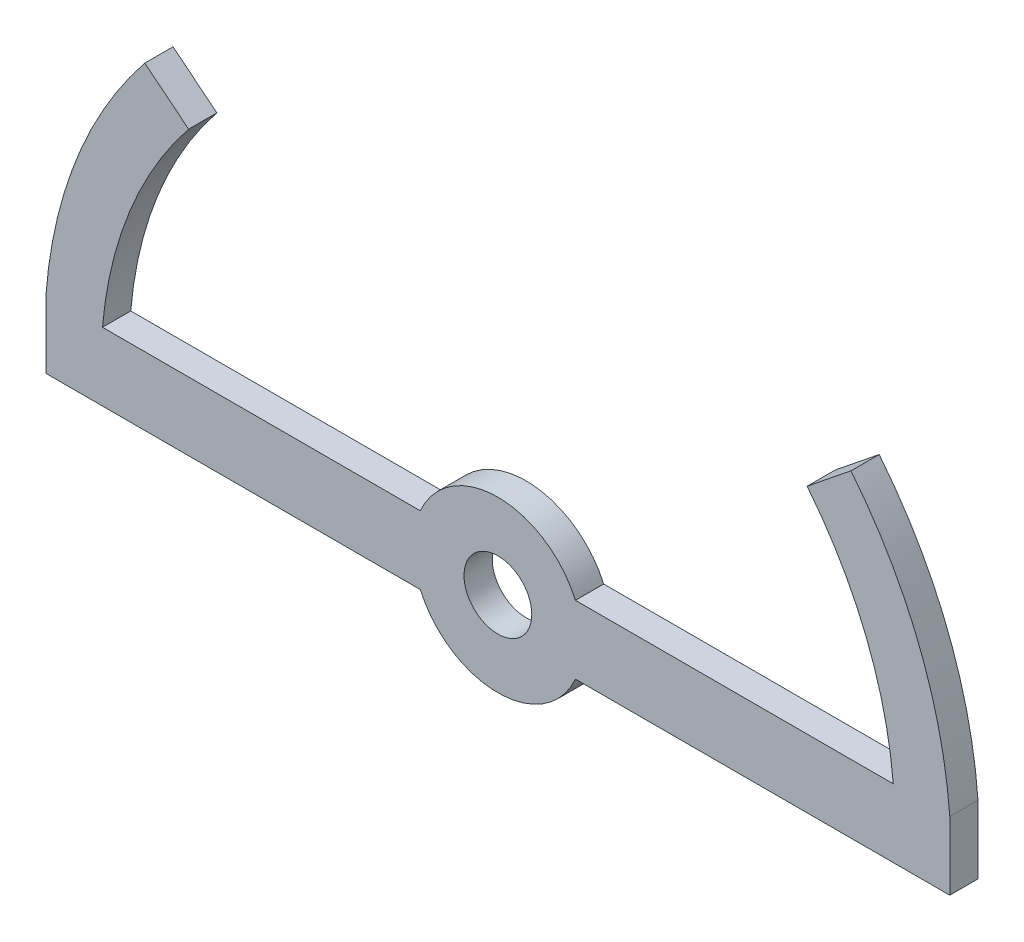
ISO-10303-21;
HEADER;
FILE_DESCRIPTION(('STEP AP214'),'2;1');
FILE_NAME('part.step','',(''),(''),'','','');
FILE_SCHEMA(('AUTOMOTIVE_DESIGN { 1 0 10303 214 1 1 1 1 }'));
ENDSEC;
DATA;
#1=APPLICATION_CONTEXT('core data for automotive mechanical design processes');
#2=APPLICATION_PROTOCOL_DEFINITION('international standard','automotive_design',2000,#1);
#3=PRODUCT_CONTEXT('',#1,'mechanical');
#4=PRODUCT('Part','Part','',(#3));
#5=PRODUCT_RELATED_PRODUCT_CATEGORY('part','',(#4));
#6=PRODUCT_DEFINITION_FORMATION('','',#4);
#7=PRODUCT_DEFINITION_CONTEXT('part definition',#1,'design');
#8=PRODUCT_DEFINITION('design','',#6,#7);
#9=PRODUCT_DEFINITION_SHAPE('','',#8);
#10=(LENGTH_UNIT() NAMED_UNIT(*) SI_UNIT(.MILLI.,.METRE.));
#11=(NAMED_UNIT(*) PLANE_ANGLE_UNIT() SI_UNIT($,.RADIAN.));
#12=(NAMED_UNIT(*) SI_UNIT($,.STERADIAN.) SOLID_ANGLE_UNIT());
#13=UNCERTAINTY_MEASURE_WITH_UNIT(LENGTH_MEASURE(1.E-05),#10,'distance_accuracy_value','');
#14=(GEOMETRIC_REPRESENTATION_CONTEXT(3) GLOBAL_UNCERTAINTY_ASSIGNED_CONTEXT((#13)) GLOBAL_UNIT_ASSIGNED_CONTEXT((#10,
#11,#12)) REPRESENTATION_CONTEXT('',''));
#15=CARTESIAN_POINT('',(0.,0.,0.));
#16=DIRECTION('',(0.,0.,1.));
#17=DIRECTION('',(1.,0.,0.));
#18=AXIS2_PLACEMENT_3D('',#15,#16,#17);
#19=CARTESIAN_POINT('',(0.,0.,-24.2132034355964));
#20=DIRECTION('',(0.,0.,1.));
#21=DIRECTION('',(1.,0.,0.));
#22=AXIS2_PLACEMENT_3D('',#19,#20,#21);
#23=CYLINDRICAL_SURFACE('',#22,7.5);
#24=DIRECTION('',(0.,0.,1.));
#25=VECTOR('',#24,1.);
#26=CARTESIAN_POINT('',(6.86513532213109,-3.01992003351547,-24.2132034355964));
#27=LINE('',#26,#25);
#28=CARTESIAN_POINT('',(6.86513532213109,-3.01992003351547,0.));
#29=VERTEX_POINT('',#28);
#30=CARTESIAN_POINT('',(6.86513532213109,-3.01992003351547,-2.49999999999998));
#31=VERTEX_POINT('',#30);
#32=EDGE_CURVE('E234',#29,#31,#27,.F.);
#33=ORIENTED_EDGE('',*,*,#32,.F.);
#34=CARTESIAN_POINT('',(0.,0.,0.));
#35=DIRECTION('',(0.,0.,1.));
#36=DIRECTION('',(1.,0.,0.));
#37=AXIS2_PLACEMENT_3D('',#34,#35,#36);
#38=CIRCLE('',#37,7.5);
#39=CARTESIAN_POINT('',(-6.86513532213109,-3.01992003351547,0.));
#40=VERTEX_POINT('',#39);
#41=EDGE_CURVE('E241',#40,#29,#38,.T.);
#42=ORIENTED_EDGE('',*,*,#41,.F.);
#43=DIRECTION('',(0.,0.,1.));
#44=VECTOR('',#43,1.);
#45=CARTESIAN_POINT('',(-6.86513532213109,-3.01992003351547,-24.2132034355964));
#46=LINE('',#45,#44);
#47=CARTESIAN_POINT('',(-6.86513532213109,-3.01992003351547,-2.49999999999998));
#48=VERTEX_POINT('',#47);
#49=EDGE_CURVE('E231',#48,#40,#46,.T.);
#50=ORIENTED_EDGE('',*,*,#49,.F.);
#51=CARTESIAN_POINT('',(0.,0.,-2.49999999999999));
#52=DIRECTION('',(0.,0.,1.));
#53=DIRECTION('',(1.,0.,0.));
#54=AXIS2_PLACEMENT_3D('',#51,#52,#53);
#55=CIRCLE('',#54,7.5);
#56=EDGE_CURVE('E41',#31,#48,#55,.F.);
#57=ORIENTED_EDGE('',*,*,#56,.F.);
#58=EDGE_LOOP('',(#33,#42,#50,#57));
#59=FACE_BOUND('',#58,.T.);
#60=ADVANCED_FACE('F33',(#59),#23,.T.);
#61=DIRECTION('',(0.,0.,1.));
#62=VECTOR('',#61,1.);
#63=CARTESIAN_POINT('',(-6.86513532213109,3.01992003351546,-24.2132034355964));
#64=LINE('',#63,#62);
#65=CARTESIAN_POINT('',(-6.86513532213109,3.01992003351546,0.));
#66=VERTEX_POINT('',#65);
#67=CARTESIAN_POINT('',(-6.86513532213109,3.01992003351546,-2.49999999999998));
#68=VERTEX_POINT('',#67);
#69=EDGE_CURVE('E228',#66,#68,#64,.F.);
#70=ORIENTED_EDGE('',*,*,#69,.F.);
#71=CARTESIAN_POINT('',(6.86513532213109,3.01992003351546,0.));
#72=VERTEX_POINT('',#71);
#73=EDGE_CURVE('E242',#72,#66,#38,.T.);
#74=ORIENTED_EDGE('',*,*,#73,.F.);
#75=DIRECTION('',(0.,0.,1.));
#76=VECTOR('',#75,1.);
#77=CARTESIAN_POINT('',(6.86513532213109,3.01992003351546,-24.2132034355964));
#78=LINE('',#77,#76);
#79=CARTESIAN_POINT('',(6.86513532213109,3.01992003351546,-2.49999999999998));
#80=VERTEX_POINT('',#79);
#81=EDGE_CURVE('E198',#80,#72,#78,.T.);
#82=ORIENTED_EDGE('',*,*,#81,.F.);
#83=EDGE_CURVE('E239',#68,#80,#55,.F.);
#84=ORIENTED_EDGE('',*,*,#83,.F.);
#85=EDGE_LOOP('',(#70,#74,#82,#84));
#86=FACE_BOUND('',#85,.T.);
#87=ADVANCED_FACE('F35',(#86),#23,.T.);
#88=CARTESIAN_POINT('',(0.,0.,0.));
#89=DIRECTION('',(0.,0.,1.));
#90=DIRECTION('',(1.,0.,0.));
#91=AXIS2_PLACEMENT_3D('',#88,#89,#90);
#92=PLANE('',#91);
#93=ORIENTED_EDGE('',*,*,#73,.T.);
#94=DIRECTION('',(1.,0.,0.));
#95=VECTOR('',#94,1.);
#96=CARTESIAN_POINT('',(40.,3.01992003351545,0.));
#97=LINE('',#96,#95);
#98=CARTESIAN_POINT('',(-35.,3.01992003351546,0.));
#99=VERTEX_POINT('',#98);
#100=EDGE_CURVE('E208',#99,#66,#97,.T.);
#101=ORIENTED_EDGE('',*,*,#100,.F.);
#102=CARTESIAN_POINT('',(0.,0.,0.));
#103=DIRECTION('',(0.,0.,1.));
#104=DIRECTION('',(1.,0.,0.));
#105=AXIS2_PLACEMENT_3D('',#102,#103,#104);
#106=CIRCLE('',#105,35.1300429406061);
#107=CARTESIAN_POINT('',(-27.3723042275657,22.0199200335155,0.));
#108=VERTEX_POINT('',#107);
#109=EDGE_CURVE('E189',#108,#99,#106,.T.);
#110=ORIENTED_EDGE('',*,*,#109,.F.);
#111=DIRECTION('',(0.779170816097313,-0.62681164582532,0.));
#112=VECTOR('',#111,1.);
#113=CARTESIAN_POINT('',(-27.3723042275657,22.0199200335155,0.));
#114=LINE('',#113,#112);
#115=CARTESIAN_POINT('',(-31.2555310940811,25.1438201758555,0.));
#116=VERTEX_POINT('',#115);
#117=EDGE_CURVE('E175',#116,#108,#114,.T.);
#118=ORIENTED_EDGE('',*,*,#117,.F.);
#119=CARTESIAN_POINT('',(0.,0.,0.));
#120=DIRECTION('',(0.,0.,1.));
#121=DIRECTION('',(1.,0.,0.));
#122=AXIS2_PLACEMENT_3D('',#119,#120,#121);
#123=CIRCLE('',#122,40.113836976894);
#124=CARTESIAN_POINT('',(-40.,3.01992003351546,0.));
#125=VERTEX_POINT('',#124);
#126=EDGE_CURVE('E184',#125,#116,#123,.F.);
#127=ORIENTED_EDGE('',*,*,#126,.F.);
#128=DIRECTION('',(0.,1.,0.));
#129=VECTOR('',#128,1.);
#130=CARTESIAN_POINT('',(-40.,-3.01992003351546,0.));
#131=LINE('',#130,#129);
#132=CARTESIAN_POINT('',(-40.,-3.01992003351546,0.));
#133=VERTEX_POINT('',#132);
#134=EDGE_CURVE('E194',#133,#125,#131,.T.);
#135=ORIENTED_EDGE('',*,*,#134,.F.);
#136=DIRECTION('',(-1.,0.,0.));
#137=VECTOR('',#136,1.);
#138=CARTESIAN_POINT('',(40.,-3.01992003351547,0.));
#139=LINE('',#138,#137);
#140=EDGE_CURVE('E216',#40,#133,#139,.T.);
#141=ORIENTED_EDGE('',*,*,#140,.F.);
#142=ORIENTED_EDGE('',*,*,#41,.T.);
#143=CARTESIAN_POINT('',(40.,-3.01992003351547,0.));
#144=VERTEX_POINT('',#143);
#145=EDGE_CURVE('E213',#144,#29,#139,.T.);
#146=ORIENTED_EDGE('',*,*,#145,.F.);
#147=DIRECTION('',(0.,-1.,0.));
#148=VECTOR('',#147,1.);
#149=CARTESIAN_POINT('',(40.,-3.01992003351547,0.));
#150=LINE('',#149,#148);
#151=CARTESIAN_POINT('',(40.,3.01992003351545,0.));
#152=VERTEX_POINT('',#151);
#153=EDGE_CURVE('E217',#152,#144,#150,.T.);
#154=ORIENTED_EDGE('',*,*,#153,.F.);
#155=CARTESIAN_POINT('',(0.,0.,0.));
#156=DIRECTION('',(0.,0.,1.));
#157=DIRECTION('',(1.,0.,0.));
#158=AXIS2_PLACEMENT_3D('',#155,#156,#157);
#159=CIRCLE('',#158,40.113836976894);
#160=CARTESIAN_POINT('',(31.2555310940811,25.1438201758555,0.));
#161=VERTEX_POINT('',#160);
#162=EDGE_CURVE('E143',#161,#152,#159,.F.);
#163=ORIENTED_EDGE('',*,*,#162,.F.);
#164=DIRECTION('',(0.779170816097313,0.62681164582532,0.));
#165=VECTOR('',#164,1.);
#166=CARTESIAN_POINT('',(27.3723042275657,22.0199200335155,0.));
#167=LINE('',#166,#165);
#168=CARTESIAN_POINT('',(27.3723042275657,22.0199200335155,0.));
#169=VERTEX_POINT('',#168);
#170=EDGE_CURVE('E140',#169,#161,#167,.T.);
#171=ORIENTED_EDGE('',*,*,#170,.F.);
#172=CARTESIAN_POINT('',(0.,0.,0.));
#173=DIRECTION('',(0.,0.,1.));
#174=DIRECTION('',(1.,0.,0.));
#175=AXIS2_PLACEMENT_3D('',#172,#173,#174);
#176=CIRCLE('',#175,35.1300429406061);
#177=CARTESIAN_POINT('',(35.,3.01992003351545,0.));
#178=VERTEX_POINT('',#177);
#179=EDGE_CURVE('E161',#178,#169,#176,.T.);
#180=ORIENTED_EDGE('',*,*,#179,.F.);
#181=EDGE_CURVE('E48',#72,#178,#97,.T.);
#182=ORIENTED_EDGE('',*,*,#181,.F.);
#183=EDGE_LOOP('',(#93,#101,#110,#118,#127,#135,#141,#142,#146,#154,#163,#171,#180,#182));
#184=FACE_BOUND('',#183,.T.);
#185=CARTESIAN_POINT('',(0.,0.,0.));
#186=DIRECTION('',(0.,0.,1.));
#187=DIRECTION('',(1.,0.,0.));
#188=AXIS2_PLACEMENT_3D('',#185,#186,#187);
#189=CIRCLE('',#188,3.);
#190=CARTESIAN_POINT('',(3.,0.,0.));
#191=VERTEX_POINT('',#190);
#192=EDGE_CURVE('E236',#191,#191,#189,.T.);
#193=ORIENTED_EDGE('',*,*,#192,.F.);
#194=EDGE_LOOP('',(#193));
#195=FACE_BOUND('',#194,.T.);
#196=ADVANCED_FACE('F249',(#184,#195),#92,.T.);
#197=CARTESIAN_POINT('',(0.,0.,-24.2132034355964));
#198=DIRECTION('',(0.,0.,1.));
#199=DIRECTION('',(1.,0.,0.));
#200=AXIS2_PLACEMENT_3D('',#197,#198,#199);
#201=CYLINDRICAL_SURFACE('',#200,3.);
#202=CARTESIAN_POINT('',(0.,0.,-2.49999999999999));
#203=DIRECTION('',(0.,0.,1.));
#204=DIRECTION('',(1.,0.,0.));
#205=AXIS2_PLACEMENT_3D('',#202,#203,#204);
#206=CIRCLE('',#205,3.);
#207=CARTESIAN_POINT('',(3.,0.,-2.49999999999999));
#208=VERTEX_POINT('',#207);
#209=EDGE_CURVE('E12',#208,#208,#206,.F.);
#210=ORIENTED_EDGE('',*,*,#209,.T.);
#211=EDGE_LOOP('',(#210));
#212=FACE_BOUND('',#211,.T.);
#213=ORIENTED_EDGE('',*,*,#192,.T.);
#214=EDGE_LOOP('',(#213));
#215=FACE_BOUND('',#214,.T.);
#216=ADVANCED_FACE('F283',(#212,#215),#201,.F.);
#217=CARTESIAN_POINT('',(0.,0.,-2.49999999999998));
#218=DIRECTION('',(0.,0.,1.));
#219=DIRECTION('',(0.997914380415625,0.0645514473865562,0.));
#220=AXIS2_PLACEMENT_3D('',#217,#218,#219);
#221=PLANE('',#220);
#222=ORIENTED_EDGE('',*,*,#83,.T.);
#223=DIRECTION('',(1.,0.,0.));
#224=VECTOR('',#223,1.);
#225=CARTESIAN_POINT('',(40.,3.01992003351545,-2.49999999999998));
#226=LINE('',#225,#224);
#227=CARTESIAN_POINT('',(35.,3.01992003351545,-2.49999999999998));
#228=VERTEX_POINT('',#227);
#229=EDGE_CURVE('E204',#80,#228,#226,.T.);
#230=ORIENTED_EDGE('',*,*,#229,.T.);
#231=CARTESIAN_POINT('',(0.,0.,-2.49999999999998));
#232=DIRECTION('',(0.,0.,1.));
#233=DIRECTION('',(1.,0.,0.));
#234=AXIS2_PLACEMENT_3D('',#231,#232,#233);
#235=CIRCLE('',#234,35.1300429406061);
#236=CARTESIAN_POINT('',(27.3723042275657,22.0199200335155,-2.49999999999998));
#237=VERTEX_POINT('',#236);
#238=EDGE_CURVE('E153',#228,#237,#235,.T.);
#239=ORIENTED_EDGE('',*,*,#238,.T.);
#240=DIRECTION('',(0.779170816097313,0.62681164582532,0.));
#241=VECTOR('',#240,1.);
#242=CARTESIAN_POINT('',(27.3723042275657,22.0199200335155,-2.49999999999998));
#243=LINE('',#242,#241);
#244=CARTESIAN_POINT('',(31.2555310940811,25.1438201758555,-2.49999999999998));
#245=VERTEX_POINT('',#244);
#246=EDGE_CURVE('E139',#237,#245,#243,.T.);
#247=ORIENTED_EDGE('',*,*,#246,.T.);
#248=CARTESIAN_POINT('',(0.,0.,-2.49999999999998));
#249=DIRECTION('',(0.,0.,-1.));
#250=DIRECTION('',(1.,0.,0.));
#251=AXIS2_PLACEMENT_3D('',#248,#249,#250);
#252=CIRCLE('',#251,40.113836976894);
#253=CARTESIAN_POINT('',(40.,3.01992003351546,-2.49999999999998));
#254=VERTEX_POINT('',#253);
#255=EDGE_CURVE('E147',#245,#254,#252,.T.);
#256=ORIENTED_EDGE('',*,*,#255,.T.);
#257=DIRECTION('',(0.,-1.,0.));
#258=VECTOR('',#257,1.);
#259=CARTESIAN_POINT('',(40.,-3.01992003351547,-2.49999999999998));
#260=LINE('',#259,#258);
#261=CARTESIAN_POINT('',(40.,-3.01992003351547,-2.49999999999998));
#262=VERTEX_POINT('',#261);
#263=EDGE_CURVE('E200',#254,#262,#260,.T.);
#264=ORIENTED_EDGE('',*,*,#263,.T.);
#265=DIRECTION('',(-1.,0.,0.));
#266=VECTOR('',#265,1.);
#267=CARTESIAN_POINT('',(40.,-3.01992003351547,-2.49999999999998));
#268=LINE('',#267,#266);
#269=EDGE_CURVE('E195',#262,#31,#268,.T.);
#270=ORIENTED_EDGE('',*,*,#269,.T.);
#271=ORIENTED_EDGE('',*,*,#56,.T.);
#272=CARTESIAN_POINT('',(-40.,-3.01992003351546,-2.49999999999998));
#273=VERTEX_POINT('',#272);
#274=EDGE_CURVE('E199',#48,#273,#268,.T.);
#275=ORIENTED_EDGE('',*,*,#274,.T.);
#276=DIRECTION('',(0.,1.,0.));
#277=VECTOR('',#276,1.);
#278=CARTESIAN_POINT('',(-40.,-3.01992003351546,-2.49999999999998));
#279=LINE('',#278,#277);
#280=CARTESIAN_POINT('',(-40.,3.01992003351546,-2.49999999999998));
#281=VERTEX_POINT('',#280);
#282=EDGE_CURVE('E205',#273,#281,#279,.T.);
#283=ORIENTED_EDGE('',*,*,#282,.T.);
#284=CARTESIAN_POINT('',(0.,0.,-2.49999999999998));
#285=DIRECTION('',(0.,0.,-1.));
#286=DIRECTION('',(-1.,0.,0.));
#287=AXIS2_PLACEMENT_3D('',#284,#285,#286);
#288=CIRCLE('',#287,40.113836976894);
#289=CARTESIAN_POINT('',(-31.2555310940811,25.1438201758555,-2.49999999999998));
#290=VERTEX_POINT('',#289);
#291=EDGE_CURVE('E166',#281,#290,#288,.T.);
#292=ORIENTED_EDGE('',*,*,#291,.T.);
#293=DIRECTION('',(0.779170816097313,-0.62681164582532,0.));
#294=VECTOR('',#293,1.);
#295=CARTESIAN_POINT('',(-27.3723042275657,22.0199200335155,-2.49999999999998));
#296=LINE('',#295,#294);
#297=CARTESIAN_POINT('',(-27.3723042275657,22.0199200335155,-2.49999999999998));
#298=VERTEX_POINT('',#297);
#299=EDGE_CURVE('E176',#290,#298,#296,.T.);
#300=ORIENTED_EDGE('',*,*,#299,.T.);
#301=CARTESIAN_POINT('',(0.,0.,-2.49999999999998));
#302=DIRECTION('',(0.,0.,1.));
#303=DIRECTION('',(-1.,0.,0.));
#304=AXIS2_PLACEMENT_3D('',#301,#302,#303);
#305=CIRCLE('',#304,35.1300429406061);
#306=CARTESIAN_POINT('',(-35.,3.01992003351546,-2.49999999999998));
#307=VERTEX_POINT('',#306);
#308=EDGE_CURVE('E172',#298,#307,#305,.T.);
#309=ORIENTED_EDGE('',*,*,#308,.T.);
#310=EDGE_CURVE('E202',#307,#68,#226,.T.);
#311=ORIENTED_EDGE('',*,*,#310,.T.);
#312=EDGE_LOOP('',(#222,#230,#239,#247,#256,#264,#270,#271,#275,#283,#292,#300,#309,#311));
#313=FACE_BOUND('',#312,.T.);
#314=ORIENTED_EDGE('',*,*,#209,.F.);
#315=EDGE_LOOP('',(#314));
#316=FACE_BOUND('',#315,.T.);
#317=ADVANCED_FACE('F157',(#313,#316),#221,.F.);
#318=CARTESIAN_POINT('',(40.,-3.01992003351547,80.227673953788));
#319=DIRECTION('',(1.,0.,0.));
#320=DIRECTION('',(0.,0.,-1.));
#321=AXIS2_PLACEMENT_3D('',#318,#319,#320);
#322=PLANE('',#321);
#323=DIRECTION('',(0.,0.,-1.));
#324=VECTOR('',#323,1.);
#325=CARTESIAN_POINT('',(40.,3.01992003351545,80.227673953788));
#326=LINE('',#325,#324);
#327=EDGE_CURVE('E150',#152,#254,#326,.T.);
#328=ORIENTED_EDGE('',*,*,#327,.F.);
#329=ORIENTED_EDGE('',*,*,#153,.T.);
#330=DIRECTION('',(0.,0.,-1.));
#331=VECTOR('',#330,1.);
#332=CARTESIAN_POINT('',(40.,-3.01992003351547,80.227673953788));
#333=LINE('',#332,#331);
#334=EDGE_CURVE('E220',#144,#262,#333,.T.);
#335=ORIENTED_EDGE('',*,*,#334,.T.);
#336=ORIENTED_EDGE('',*,*,#263,.F.);
#337=EDGE_LOOP('',(#328,#329,#335,#336));
#338=FACE_BOUND('',#337,.T.);
#339=ADVANCED_FACE('F261',(#338),#322,.T.);
#340=CARTESIAN_POINT('',(40.,3.01992003351545,80.227673953788));
#341=DIRECTION('',(0.,1.,0.));
#342=DIRECTION('',(-1.,0.,0.));
#343=AXIS2_PLACEMENT_3D('',#340,#341,#342);
#344=PLANE('',#343);
#345=DIRECTION('',(0.,0.,-1.));
#346=VECTOR('',#345,1.);
#347=CARTESIAN_POINT('',(35.,3.01992003351546,25.474019275124));
#348=LINE('',#347,#346);
#349=EDGE_CURVE('E53',#178,#228,#348,.T.);
#350=ORIENTED_EDGE('',*,*,#349,.T.);
#351=ORIENTED_EDGE('',*,*,#229,.F.);
#352=ORIENTED_EDGE('',*,*,#81,.T.);
#353=ORIENTED_EDGE('',*,*,#181,.T.);
#354=EDGE_LOOP('',(#350,#351,#352,#353));
#355=FACE_BOUND('',#354,.T.);
#356=ADVANCED_FACE('F305',(#355),#344,.T.);
#357=CARTESIAN_POINT('',(40.,-3.01992003351547,80.227673953788));
#358=DIRECTION('',(0.,-1.,0.));
#359=DIRECTION('',(1.,0.,0.));
#360=AXIS2_PLACEMENT_3D('',#357,#358,#359);
#361=PLANE('',#360);
#362=ORIENTED_EDGE('',*,*,#145,.T.);
#363=ORIENTED_EDGE('',*,*,#32,.T.);
#364=ORIENTED_EDGE('',*,*,#269,.F.);
#365=ORIENTED_EDGE('',*,*,#334,.F.);
#366=EDGE_LOOP('',(#362,#363,#364,#365));
#367=FACE_BOUND('',#366,.T.);
#368=ADVANCED_FACE('F259',(#367),#361,.T.);
#369=DIRECTION('',(0.,0.,-1.));
#370=VECTOR('',#369,1.);
#371=CARTESIAN_POINT('',(-35.,3.01992003351546,25.474019275124));
#372=LINE('',#371,#370);
#373=EDGE_CURVE('E188',#99,#307,#372,.T.);
#374=ORIENTED_EDGE('',*,*,#373,.F.);
#375=ORIENTED_EDGE('',*,*,#100,.T.);
#376=ORIENTED_EDGE('',*,*,#69,.T.);
#377=ORIENTED_EDGE('',*,*,#310,.F.);
#378=EDGE_LOOP('',(#374,#375,#376,#377));
#379=FACE_BOUND('',#378,.T.);
#380=ADVANCED_FACE('F290',(#379),#344,.T.);
#381=CARTESIAN_POINT('',(-40.,-3.01992003351546,80.227673953788));
#382=DIRECTION('',(-1.,0.,0.));
#383=DIRECTION('',(0.,0.,1.));
#384=AXIS2_PLACEMENT_3D('',#381,#382,#383);
#385=PLANE('',#384);
#386=DIRECTION('',(0.,0.,-1.));
#387=VECTOR('',#386,1.);
#388=CARTESIAN_POINT('',(-40.,-3.01992003351546,80.227673953788));
#389=LINE('',#388,#387);
#390=EDGE_CURVE('E215',#133,#273,#389,.T.);
#391=ORIENTED_EDGE('',*,*,#390,.F.);
#392=ORIENTED_EDGE('',*,*,#134,.T.);
#393=DIRECTION('',(0.,0.,-1.));
#394=VECTOR('',#393,1.);
#395=CARTESIAN_POINT('',(-40.,3.01992003351546,80.227673953788));
#396=LINE('',#395,#394);
#397=EDGE_CURVE('E212',#125,#281,#396,.T.);
#398=ORIENTED_EDGE('',*,*,#397,.T.);
#399=ORIENTED_EDGE('',*,*,#282,.F.);
#400=EDGE_LOOP('',(#391,#392,#398,#399));
#401=FACE_BOUND('',#400,.T.);
#402=ADVANCED_FACE('F302',(#401),#385,.T.);
#403=ORIENTED_EDGE('',*,*,#274,.F.);
#404=ORIENTED_EDGE('',*,*,#49,.T.);
#405=ORIENTED_EDGE('',*,*,#140,.T.);
#406=ORIENTED_EDGE('',*,*,#390,.T.);
#407=EDGE_LOOP('',(#403,#404,#405,#406));
#408=FACE_BOUND('',#407,.T.);
#409=ADVANCED_FACE('F304',(#408),#361,.T.);
#410=CARTESIAN_POINT('',(-27.3723042275657,22.0199200335155,25.474019275124));
#411=DIRECTION('',(0.62681164582532,0.779170816097313,0.));
#412=DIRECTION('',(-0.779170816097313,0.62681164582532,0.));
#413=AXIS2_PLACEMENT_3D('',#410,#411,#412);
#414=PLANE('',#413);
#415=DIRECTION('',(0.,0.,-1.));
#416=VECTOR('',#415,1.);
#417=CARTESIAN_POINT('',(-31.2555310940811,25.1438201758555,25.474019275124));
#418=LINE('',#417,#416);
#419=EDGE_CURVE('E187',#116,#290,#418,.T.);
#420=ORIENTED_EDGE('',*,*,#419,.F.);
#421=ORIENTED_EDGE('',*,*,#117,.T.);
#422=DIRECTION('',(0.,0.,-1.));
#423=VECTOR('',#422,1.);
#424=CARTESIAN_POINT('',(-27.3723042275657,22.0199200335155,25.474019275124));
#425=LINE('',#424,#423);
#426=EDGE_CURVE('E183',#108,#298,#425,.T.);
#427=ORIENTED_EDGE('',*,*,#426,.T.);
#428=ORIENTED_EDGE('',*,*,#299,.F.);
#429=EDGE_LOOP('',(#420,#421,#427,#428));
#430=FACE_BOUND('',#429,.T.);
#431=ADVANCED_FACE('F297',(#430),#414,.T.);
#432=CARTESIAN_POINT('',(0.,0.,25.474019275124));
#433=DIRECTION('',(0.,0.,-1.));
#434=DIRECTION('',(-1.,0.,0.));
#435=AXIS2_PLACEMENT_3D('',#432,#433,#434);
#436=CYLINDRICAL_SURFACE('',#435,35.1300429406061);
#437=ORIENTED_EDGE('',*,*,#426,.F.);
#438=ORIENTED_EDGE('',*,*,#109,.T.);
#439=ORIENTED_EDGE('',*,*,#373,.T.);
#440=ORIENTED_EDGE('',*,*,#308,.F.);
#441=EDGE_LOOP('',(#437,#438,#439,#440));
#442=FACE_BOUND('',#441,.T.);
#443=ADVANCED_FACE('F272',(#442),#436,.F.);
#444=CARTESIAN_POINT('',(0.,0.,25.474019275124));
#445=DIRECTION('',(0.,0.,-1.));
#446=DIRECTION('',(-1.,0.,0.));
#447=AXIS2_PLACEMENT_3D('',#444,#445,#446);
#448=CYLINDRICAL_SURFACE('',#447,40.113836976894);
#449=ORIENTED_EDGE('',*,*,#397,.F.);
#450=ORIENTED_EDGE('',*,*,#126,.T.);
#451=ORIENTED_EDGE('',*,*,#419,.T.);
#452=ORIENTED_EDGE('',*,*,#291,.F.);
#453=EDGE_LOOP('',(#449,#450,#451,#452));
#454=FACE_BOUND('',#453,.T.);
#455=ADVANCED_FACE('F265',(#454),#448,.T.);
#456=CARTESIAN_POINT('',(0.,0.,25.474019275124));
#457=DIRECTION('',(0.,0.,-1.));
#458=DIRECTION('',(-1.,0.,0.));
#459=AXIS2_PLACEMENT_3D('',#456,#457,#458);
#460=CYLINDRICAL_SURFACE('',#459,35.1300429406061);
#461=ORIENTED_EDGE('',*,*,#349,.F.);
#462=ORIENTED_EDGE('',*,*,#179,.T.);
#463=DIRECTION('',(0.,0.,-1.));
#464=VECTOR('',#463,1.);
#465=CARTESIAN_POINT('',(27.3723042275657,22.0199200335155,25.474019275124));
#466=LINE('',#465,#464);
#467=EDGE_CURVE('E168',#169,#237,#466,.T.);
#468=ORIENTED_EDGE('',*,*,#467,.T.);
#469=ORIENTED_EDGE('',*,*,#238,.F.);
#470=EDGE_LOOP('',(#461,#462,#468,#469));
#471=FACE_BOUND('',#470,.T.);
#472=ADVANCED_FACE('F263',(#471),#460,.F.);
#473=CARTESIAN_POINT('',(27.3723042275657,22.0199200335155,25.474019275124));
#474=DIRECTION('',(-0.62681164582532,0.779170816097313,0.));
#475=DIRECTION('',(-0.779170816097313,-0.62681164582532,0.));
#476=AXIS2_PLACEMENT_3D('',#473,#474,#475);
#477=PLANE('',#476);
#478=ORIENTED_EDGE('',*,*,#467,.F.);
#479=ORIENTED_EDGE('',*,*,#170,.T.);
#480=DIRECTION('',(0.,0.,-1.));
#481=VECTOR('',#480,1.);
#482=CARTESIAN_POINT('',(31.2555310940811,25.1438201758555,25.474019275124));
#483=LINE('',#482,#481);
#484=EDGE_CURVE('E134',#161,#245,#483,.T.);
#485=ORIENTED_EDGE('',*,*,#484,.T.);
#486=ORIENTED_EDGE('',*,*,#246,.F.);
#487=EDGE_LOOP('',(#478,#479,#485,#486));
#488=FACE_BOUND('',#487,.T.);
#489=ADVANCED_FACE('F137',(#488),#477,.T.);
#490=CARTESIAN_POINT('',(0.,0.,25.474019275124));
#491=DIRECTION('',(0.,0.,-1.));
#492=DIRECTION('',(-1.,0.,0.));
#493=AXIS2_PLACEMENT_3D('',#490,#491,#492);
#494=CYLINDRICAL_SURFACE('',#493,40.113836976894);
#495=ORIENTED_EDGE('',*,*,#484,.F.);
#496=ORIENTED_EDGE('',*,*,#162,.T.);
#497=ORIENTED_EDGE('',*,*,#327,.T.);
#498=ORIENTED_EDGE('',*,*,#255,.F.);
#499=EDGE_LOOP('',(#495,#496,#497,#498));
#500=FACE_BOUND('',#499,.T.);
#501=ADVANCED_FACE('F148',(#500),#494,.T.);
#502=CLOSED_SHELL('',(#60,#87,#196,#216,#317,#339,#356,#368,#380,#402,#409,#431,#443,#455,#472,
#489,#501));
#503=MANIFOLD_SOLID_BREP('B2',#502);
#504=ADVANCED_BREP_SHAPE_REPRESENTATION('',(#18,#503),#14);
#505=SHAPE_DEFINITION_REPRESENTATION(#9,#504);
ENDSEC;
END-ISO-10303-21;
